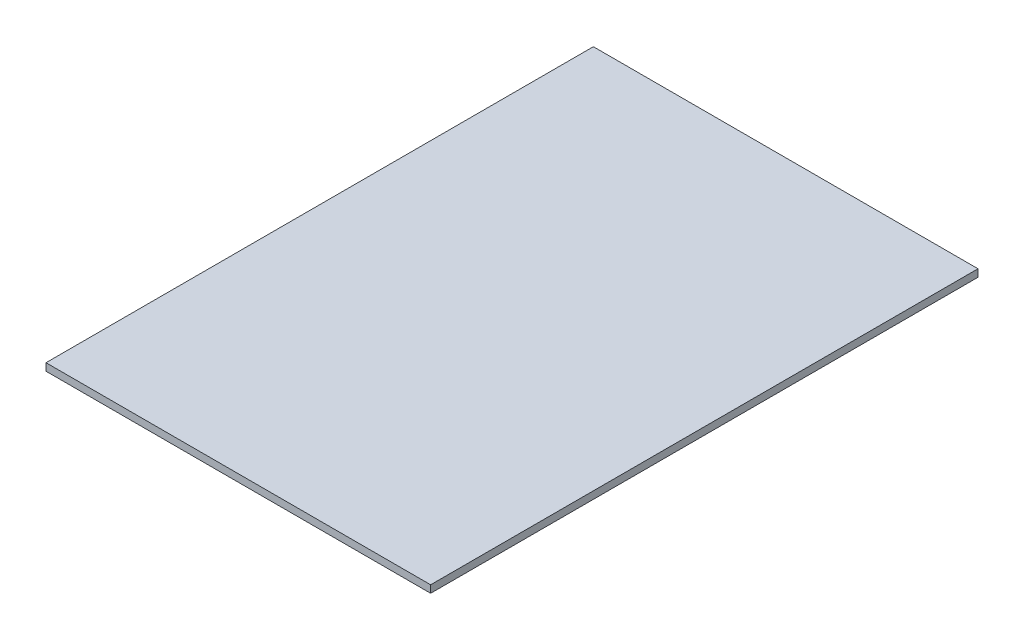
ISO-10303-21;
HEADER;
FILE_DESCRIPTION(('STEP AP214'),'2;1');
FILE_NAME('part.step','',(''),(''),'','','');
FILE_SCHEMA(('AUTOMOTIVE_DESIGN { 1 0 10303 214 1 1 1 1 }'));
ENDSEC;
DATA;
#1=APPLICATION_CONTEXT('core data for automotive mechanical design processes');
#2=APPLICATION_PROTOCOL_DEFINITION('international standard','automotive_design',2000,#1);
#3=PRODUCT_CONTEXT('',#1,'mechanical');
#4=PRODUCT('Part','Part','',(#3));
#5=PRODUCT_RELATED_PRODUCT_CATEGORY('part','',(#4));
#6=PRODUCT_DEFINITION_FORMATION('','',#4);
#7=PRODUCT_DEFINITION_CONTEXT('part definition',#1,'design');
#8=PRODUCT_DEFINITION('design','',#6,#7);
#9=PRODUCT_DEFINITION_SHAPE('','',#8);
#10=(LENGTH_UNIT() NAMED_UNIT(*) SI_UNIT(.MILLI.,.METRE.));
#11=(NAMED_UNIT(*) PLANE_ANGLE_UNIT() SI_UNIT($,.RADIAN.));
#12=(NAMED_UNIT(*) SI_UNIT($,.STERADIAN.) SOLID_ANGLE_UNIT());
#13=UNCERTAINTY_MEASURE_WITH_UNIT(LENGTH_MEASURE(1.E-05),#10,'distance_accuracy_value','');
#14=(GEOMETRIC_REPRESENTATION_CONTEXT(3) GLOBAL_UNCERTAINTY_ASSIGNED_CONTEXT((#13)) GLOBAL_UNIT_ASSIGNED_CONTEXT((#10,
#11,#12)) REPRESENTATION_CONTEXT('',''));
#15=CARTESIAN_POINT('',(0.,0.,0.));
#16=DIRECTION('',(0.,0.,1.));
#17=DIRECTION('',(1.,0.,0.));
#18=AXIS2_PLACEMENT_3D('',#15,#16,#17);
#19=CARTESIAN_POINT('',(82.55,-1.5875,-117.475));
#20=DIRECTION('',(1.,0.,0.));
#21=DIRECTION('',(0.,0.,-1.));
#22=AXIS2_PLACEMENT_3D('',#19,#20,#21);
#23=PLANE('',#22);
#24=DIRECTION('',(0.,1.,0.));
#25=VECTOR('',#24,1.);
#26=CARTESIAN_POINT('',(82.55,-1.5875,-117.475));
#27=LINE('',#26,#25);
#28=CARTESIAN_POINT('',(82.55,-1.5875,-117.475));
#29=VERTEX_POINT('',#28);
#30=CARTESIAN_POINT('',(82.55,1.5875,-117.475));
#31=VERTEX_POINT('',#30);
#32=EDGE_CURVE('E46',#29,#31,#27,.T.);
#33=ORIENTED_EDGE('',*,*,#32,.T.);
#34=DIRECTION('',(0.,0.,-1.));
#35=VECTOR('',#34,1.);
#36=CARTESIAN_POINT('',(82.55,1.5875,-117.475));
#37=LINE('',#36,#35);
#38=CARTESIAN_POINT('',(82.55,1.5875,117.475));
#39=VERTEX_POINT('',#38);
#40=EDGE_CURVE('E84',#39,#31,#37,.T.);
#41=ORIENTED_EDGE('',*,*,#40,.F.);
#42=DIRECTION('',(0.,1.,0.));
#43=VECTOR('',#42,1.);
#44=CARTESIAN_POINT('',(82.55,-1.5875,117.475));
#45=LINE('',#44,#43);
#46=CARTESIAN_POINT('',(82.55,-1.5875,117.475));
#47=VERTEX_POINT('',#46);
#48=EDGE_CURVE('E11',#47,#39,#45,.T.);
#49=ORIENTED_EDGE('',*,*,#48,.F.);
#50=DIRECTION('',(0.,0.,-1.));
#51=VECTOR('',#50,1.);
#52=CARTESIAN_POINT('',(82.55,-1.5875,-117.475));
#53=LINE('',#52,#51);
#54=EDGE_CURVE('E85',#47,#29,#53,.T.);
#55=ORIENTED_EDGE('',*,*,#54,.T.);
#56=EDGE_LOOP('',(#33,#41,#49,#55));
#57=FACE_BOUND('',#56,.T.);
#58=ADVANCED_FACE('F43',(#57),#23,.T.);
#59=CARTESIAN_POINT('',(-82.55,-1.5875,117.475));
#60=DIRECTION('',(0.,0.,1.));
#61=DIRECTION('',(1.,0.,0.));
#62=AXIS2_PLACEMENT_3D('',#59,#60,#61);
#63=PLANE('',#62);
#64=ORIENTED_EDGE('',*,*,#48,.T.);
#65=DIRECTION('',(1.,0.,0.));
#66=VECTOR('',#65,1.);
#67=CARTESIAN_POINT('',(-82.55,1.5875,117.475));
#68=LINE('',#67,#66);
#69=CARTESIAN_POINT('',(-82.55,1.5875,117.475));
#70=VERTEX_POINT('',#69);
#71=EDGE_CURVE('E103',#70,#39,#68,.T.);
#72=ORIENTED_EDGE('',*,*,#71,.F.);
#73=DIRECTION('',(0.,1.,0.));
#74=VECTOR('',#73,1.);
#75=CARTESIAN_POINT('',(-82.55,-1.5875,117.475));
#76=LINE('',#75,#74);
#77=CARTESIAN_POINT('',(-82.55,-1.5875,117.475));
#78=VERTEX_POINT('',#77);
#79=EDGE_CURVE('E52',#78,#70,#76,.T.);
#80=ORIENTED_EDGE('',*,*,#79,.F.);
#81=DIRECTION('',(1.,0.,0.));
#82=VECTOR('',#81,1.);
#83=CARTESIAN_POINT('',(-82.55,-1.5875,117.475));
#84=LINE('',#83,#82);
#85=EDGE_CURVE('E91',#78,#47,#84,.T.);
#86=ORIENTED_EDGE('',*,*,#85,.T.);
#87=EDGE_LOOP('',(#64,#72,#80,#86));
#88=FACE_BOUND('',#87,.T.);
#89=ADVANCED_FACE('F127',(#88),#63,.T.);
#90=CARTESIAN_POINT('',(-82.55,-1.5875,-117.475));
#91=DIRECTION('',(-1.,0.,0.));
#92=DIRECTION('',(0.,0.,1.));
#93=AXIS2_PLACEMENT_3D('',#90,#91,#92);
#94=PLANE('',#93);
#95=ORIENTED_EDGE('',*,*,#79,.T.);
#96=DIRECTION('',(0.,0.,1.));
#97=VECTOR('',#96,1.);
#98=CARTESIAN_POINT('',(-82.55,1.5875,-117.475));
#99=LINE('',#98,#97);
#100=CARTESIAN_POINT('',(-82.55,1.5875,-117.475));
#101=VERTEX_POINT('',#100);
#102=EDGE_CURVE('E99',#101,#70,#99,.T.);
#103=ORIENTED_EDGE('',*,*,#102,.F.);
#104=DIRECTION('',(0.,1.,0.));
#105=VECTOR('',#104,1.);
#106=CARTESIAN_POINT('',(-82.55,-1.5875,-117.475));
#107=LINE('',#106,#105);
#108=CARTESIAN_POINT('',(-82.55,-1.5875,-117.475));
#109=VERTEX_POINT('',#108);
#110=EDGE_CURVE('E90',#109,#101,#107,.T.);
#111=ORIENTED_EDGE('',*,*,#110,.F.);
#112=DIRECTION('',(0.,0.,1.));
#113=VECTOR('',#112,1.);
#114=CARTESIAN_POINT('',(-82.55,-1.5875,-117.475));
#115=LINE('',#114,#113);
#116=EDGE_CURVE('E116',#109,#78,#115,.T.);
#117=ORIENTED_EDGE('',*,*,#116,.T.);
#118=EDGE_LOOP('',(#95,#103,#111,#117));
#119=FACE_BOUND('',#118,.T.);
#120=ADVANCED_FACE('F124',(#119),#94,.T.);
#121=CARTESIAN_POINT('',(-82.55,-1.5875,-117.475));
#122=DIRECTION('',(0.,0.,-1.));
#123=DIRECTION('',(-1.,0.,0.));
#124=AXIS2_PLACEMENT_3D('',#121,#122,#123);
#125=PLANE('',#124);
#126=ORIENTED_EDGE('',*,*,#110,.T.);
#127=DIRECTION('',(-1.,0.,0.));
#128=VECTOR('',#127,1.);
#129=CARTESIAN_POINT('',(-82.55,1.5875,-117.475));
#130=LINE('',#129,#128);
#131=EDGE_CURVE('E93',#31,#101,#130,.T.);
#132=ORIENTED_EDGE('',*,*,#131,.F.);
#133=ORIENTED_EDGE('',*,*,#32,.F.);
#134=DIRECTION('',(-1.,0.,0.));
#135=VECTOR('',#134,1.);
#136=CARTESIAN_POINT('',(-82.55,-1.5875,-117.475));
#137=LINE('',#136,#135);
#138=EDGE_CURVE('E113',#29,#109,#137,.T.);
#139=ORIENTED_EDGE('',*,*,#138,.T.);
#140=EDGE_LOOP('',(#126,#132,#133,#139));
#141=FACE_BOUND('',#140,.T.);
#142=ADVANCED_FACE('F94',(#141),#125,.T.);
#143=CARTESIAN_POINT('',(0.,-1.5875,0.));
#144=DIRECTION('',(0.,1.,0.));
#145=DIRECTION('',(0.,0.,1.));
#146=AXIS2_PLACEMENT_3D('',#143,#144,#145);
#147=PLANE('',#146);
#148=ORIENTED_EDGE('',*,*,#54,.F.);
#149=ORIENTED_EDGE('',*,*,#85,.F.);
#150=ORIENTED_EDGE('',*,*,#116,.F.);
#151=ORIENTED_EDGE('',*,*,#138,.F.);
#152=EDGE_LOOP('',(#148,#149,#150,#151));
#153=FACE_BOUND('',#152,.T.);
#154=ADVANCED_FACE('F129',(#153),#147,.F.);
#155=CARTESIAN_POINT('',(0.,1.5875,0.));
#156=DIRECTION('',(0.,1.,0.));
#157=DIRECTION('',(0.,0.,1.));
#158=AXIS2_PLACEMENT_3D('',#155,#156,#157);
#159=PLANE('',#158);
#160=ORIENTED_EDGE('',*,*,#40,.T.);
#161=ORIENTED_EDGE('',*,*,#131,.T.);
#162=ORIENTED_EDGE('',*,*,#102,.T.);
#163=ORIENTED_EDGE('',*,*,#71,.T.);
#164=EDGE_LOOP('',(#160,#161,#162,#163));
#165=FACE_BOUND('',#164,.T.);
#166=ADVANCED_FACE('F102',(#165),#159,.T.);
#167=CLOSED_SHELL('',(#58,#89,#120,#142,#154,#166));
#168=MANIFOLD_SOLID_BREP('B2',#167);
#169=ADVANCED_BREP_SHAPE_REPRESENTATION('',(#18,#168),#14);
#170=SHAPE_DEFINITION_REPRESENTATION(#9,#169);
ENDSEC;
END-ISO-10303-21;
